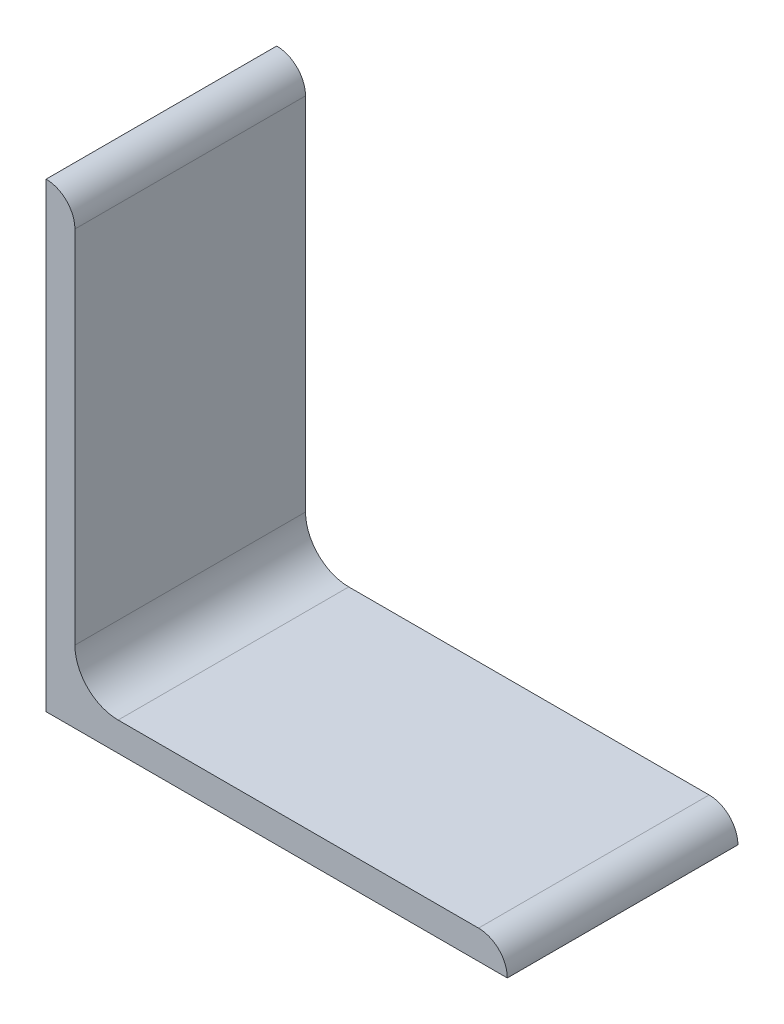
ISO-10303-21;
HEADER;
FILE_DESCRIPTION(('STEP AP214'),'2;1');
FILE_NAME('part.step','',(''),(''),'','','');
FILE_SCHEMA(('AUTOMOTIVE_DESIGN { 1 0 10303 214 1 1 1 1 }'));
ENDSEC;
DATA;
#1=APPLICATION_CONTEXT('core data for automotive mechanical design processes');
#2=APPLICATION_PROTOCOL_DEFINITION('international standard','automotive_design',2000,#1);
#3=PRODUCT_CONTEXT('',#1,'mechanical');
#4=PRODUCT('Part','Part','',(#3));
#5=PRODUCT_RELATED_PRODUCT_CATEGORY('part','',(#4));
#6=PRODUCT_DEFINITION_FORMATION('','',#4);
#7=PRODUCT_DEFINITION_CONTEXT('part definition',#1,'design');
#8=PRODUCT_DEFINITION('design','',#6,#7);
#9=PRODUCT_DEFINITION_SHAPE('','',#8);
#10=(LENGTH_UNIT() NAMED_UNIT(*) SI_UNIT(.MILLI.,.METRE.));
#11=(NAMED_UNIT(*) PLANE_ANGLE_UNIT() SI_UNIT($,.RADIAN.));
#12=(NAMED_UNIT(*) SI_UNIT($,.STERADIAN.) SOLID_ANGLE_UNIT());
#13=UNCERTAINTY_MEASURE_WITH_UNIT(LENGTH_MEASURE(1.E-05),#10,'distance_accuracy_value','');
#14=(GEOMETRIC_REPRESENTATION_CONTEXT(3) GLOBAL_UNCERTAINTY_ASSIGNED_CONTEXT((#13)) GLOBAL_UNIT_ASSIGNED_CONTEXT((#10,
#11,#12)) REPRESENTATION_CONTEXT('',''));
#15=CARTESIAN_POINT('',(0.,0.,0.));
#16=DIRECTION('',(0.,0.,1.));
#17=DIRECTION('',(1.,0.,0.));
#18=AXIS2_PLACEMENT_3D('',#15,#16,#17);
#19=CARTESIAN_POINT('',(-2.84113318571218,-8.5391888301944,46.8070937624464));
#20=DIRECTION('',(0.,1.,0.));
#21=DIRECTION('',(0.,0.,1.));
#22=AXIS2_PLACEMENT_3D('',#19,#20,#21);
#23=PLANE('',#22);
#24=DIRECTION('',(1.,0.,0.));
#25=VECTOR('',#24,1.);
#26=CARTESIAN_POINT('',(-2.84113318571218,-8.5391888301944,21.4070937624464));
#27=LINE('',#26,#25);
#28=CARTESIAN_POINT('',(-53.6411331857121,-8.5391888301944,21.4070937624464));
#29=VERTEX_POINT('',#28);
#30=CARTESIAN_POINT('',(-2.84113318571218,-8.5391888301944,21.4070937624464));
#31=VERTEX_POINT('',#30);
#32=EDGE_CURVE('E136',#29,#31,#27,.T.);
#33=ORIENTED_EDGE('',*,*,#32,.T.);
#34=DIRECTION('',(0.,0.,-1.));
#35=VECTOR('',#34,1.);
#36=CARTESIAN_POINT('',(-2.84113318571218,-8.5391888301944,46.8070937624464));
#37=LINE('',#36,#35);
#38=CARTESIAN_POINT('',(-2.84113318571218,-8.5391888301944,46.8070937624464));
#39=VERTEX_POINT('',#38);
#40=EDGE_CURVE('E11',#39,#31,#37,.T.);
#41=ORIENTED_EDGE('',*,*,#40,.F.);
#42=DIRECTION('',(1.,0.,0.));
#43=VECTOR('',#42,1.);
#44=CARTESIAN_POINT('',(-2.84113318571218,-8.5391888301944,46.8070937624464));
#45=LINE('',#44,#43);
#46=CARTESIAN_POINT('',(-53.6411331857121,-8.5391888301944,46.8070937624464));
#47=VERTEX_POINT('',#46);
#48=EDGE_CURVE('E152',#47,#39,#45,.T.);
#49=ORIENTED_EDGE('',*,*,#48,.F.);
#50=DIRECTION('',(0.,0.,-1.));
#51=VECTOR('',#50,1.);
#52=CARTESIAN_POINT('',(-53.6411331857121,-8.5391888301944,46.8070937624464));
#53=LINE('',#52,#51);
#54=EDGE_CURVE('E132',#47,#29,#53,.T.);
#55=ORIENTED_EDGE('',*,*,#54,.T.);
#56=EDGE_LOOP('',(#33,#41,#49,#55));
#57=FACE_BOUND('',#56,.T.);
#58=ADVANCED_FACE('F34',(#57),#23,.F.);
#59=CARTESIAN_POINT('',(-2.84113318571218,-8.5341088301944,46.8070937624464));
#60=DIRECTION('',(-1.,0.,0.));
#61=DIRECTION('',(0.,0.,1.));
#62=AXIS2_PLACEMENT_3D('',#59,#60,#61);
#63=PLANE('',#62);
#64=DIRECTION('',(0.,1.,0.));
#65=VECTOR('',#64,1.);
#66=CARTESIAN_POINT('',(-2.84113318571218,-8.5341088301944,21.4070937624464));
#67=LINE('',#66,#65);
#68=CARTESIAN_POINT('',(-2.84113318571218,-8.5341088301944,21.4070937624464));
#69=VERTEX_POINT('',#68);
#70=EDGE_CURVE('E139',#31,#69,#67,.T.);
#71=ORIENTED_EDGE('',*,*,#70,.T.);
#72=DIRECTION('',(0.,0.,-1.));
#73=VECTOR('',#72,1.);
#74=CARTESIAN_POINT('',(-2.84113318571218,-8.5341088301944,46.8070937624464));
#75=LINE('',#74,#73);
#76=CARTESIAN_POINT('',(-2.84113318571218,-8.5341088301944,46.8070937624464));
#77=VERTEX_POINT('',#76);
#78=EDGE_CURVE('E42',#77,#69,#75,.T.);
#79=ORIENTED_EDGE('',*,*,#78,.F.);
#80=DIRECTION('',(0.,1.,0.));
#81=VECTOR('',#80,1.);
#82=CARTESIAN_POINT('',(-2.84113318571218,-8.5341088301944,46.8070937624464));
#83=LINE('',#82,#81);
#84=EDGE_CURVE('E96',#39,#77,#83,.T.);
#85=ORIENTED_EDGE('',*,*,#84,.F.);
#86=ORIENTED_EDGE('',*,*,#40,.T.);
#87=EDGE_LOOP('',(#71,#79,#85,#86));
#88=FACE_BOUND('',#87,.T.);
#89=ADVANCED_FACE('F195',(#88),#63,.F.);
#90=CARTESIAN_POINT('',(-6.01105318571217,-8.5341088301944,46.8070937624464));
#91=DIRECTION('',(0.,0.,-1.));
#92=DIRECTION('',(-1.,0.,0.));
#93=AXIS2_PLACEMENT_3D('',#90,#91,#92);
#94=CYLINDRICAL_SURFACE('',#93,3.16991999999999);
#95=CARTESIAN_POINT('',(-6.01105318571217,-8.5341088301944,21.4070937624464));
#96=DIRECTION('',(0.,0.,1.));
#97=DIRECTION('',(1.,0.,0.));
#98=AXIS2_PLACEMENT_3D('',#95,#96,#97);
#99=CIRCLE('',#98,3.16991999999999);
#100=CARTESIAN_POINT('',(-6.01105318571217,-5.36418883019441,21.4070937624464));
#101=VERTEX_POINT('',#100);
#102=EDGE_CURVE('E141',#69,#101,#99,.T.);
#103=ORIENTED_EDGE('',*,*,#102,.T.);
#104=DIRECTION('',(0.,0.,-1.));
#105=VECTOR('',#104,1.);
#106=CARTESIAN_POINT('',(-6.01105318571217,-5.36418883019441,46.8070937624464));
#107=LINE('',#106,#105);
#108=CARTESIAN_POINT('',(-6.01105318571217,-5.36418883019441,46.8070937624464));
#109=VERTEX_POINT('',#108);
#110=EDGE_CURVE('E162',#109,#101,#107,.T.);
#111=ORIENTED_EDGE('',*,*,#110,.F.);
#112=CARTESIAN_POINT('',(-6.01105318571217,-8.5341088301944,46.8070937624464));
#113=DIRECTION('',(0.,0.,1.));
#114=DIRECTION('',(1.,0.,0.));
#115=AXIS2_PLACEMENT_3D('',#112,#113,#114);
#116=CIRCLE('',#115,3.16991999999999);
#117=EDGE_CURVE('E170',#77,#109,#116,.T.);
#118=ORIENTED_EDGE('',*,*,#117,.F.);
#119=ORIENTED_EDGE('',*,*,#78,.T.);
#120=EDGE_LOOP('',(#103,#111,#118,#119));
#121=FACE_BOUND('',#120,.T.);
#122=ADVANCED_FACE('F168',(#121),#94,.T.);
#123=CARTESIAN_POINT('',(-45.7036331857121,-5.36418883019441,46.8070937624464));
#124=DIRECTION('',(0.,-1.,0.));
#125=DIRECTION('',(1.,0.,0.));
#126=AXIS2_PLACEMENT_3D('',#123,#124,#125);
#127=PLANE('',#126);
#128=DIRECTION('',(-1.,0.,0.));
#129=VECTOR('',#128,1.);
#130=CARTESIAN_POINT('',(-45.7036331857121,-5.36418883019441,21.4070937624464));
#131=LINE('',#130,#129);
#132=CARTESIAN_POINT('',(-45.7036331857121,-5.36418883019441,21.4070937624464));
#133=VERTEX_POINT('',#132);
#134=EDGE_CURVE('E143',#101,#133,#131,.T.);
#135=ORIENTED_EDGE('',*,*,#134,.T.);
#136=DIRECTION('',(0.,0.,-1.));
#137=VECTOR('',#136,1.);
#138=CARTESIAN_POINT('',(-45.7036331857121,-5.36418883019441,46.8070937624464));
#139=LINE('',#138,#137);
#140=CARTESIAN_POINT('',(-45.7036331857121,-5.36418883019441,46.8070937624464));
#141=VERTEX_POINT('',#140);
#142=EDGE_CURVE('E159',#141,#133,#139,.T.);
#143=ORIENTED_EDGE('',*,*,#142,.F.);
#144=DIRECTION('',(-1.,0.,0.));
#145=VECTOR('',#144,1.);
#146=CARTESIAN_POINT('',(-45.7036331857121,-5.36418883019441,46.8070937624464));
#147=LINE('',#146,#145);
#148=EDGE_CURVE('E186',#109,#141,#147,.T.);
#149=ORIENTED_EDGE('',*,*,#148,.F.);
#150=ORIENTED_EDGE('',*,*,#110,.T.);
#151=EDGE_LOOP('',(#135,#143,#149,#150));
#152=FACE_BOUND('',#151,.T.);
#153=ADVANCED_FACE('F179',(#152),#127,.F.);
#154=CARTESIAN_POINT('',(-45.7036331857121,-0.601688830194409,46.8070937624464));
#155=DIRECTION('',(0.,0.,-1.));
#156=DIRECTION('',(-1.,0.,0.));
#157=AXIS2_PLACEMENT_3D('',#154,#155,#156);
#158=CYLINDRICAL_SURFACE('',#157,4.7625);
#159=CARTESIAN_POINT('',(-45.7036331857121,-0.601688830194409,21.4070937624464));
#160=DIRECTION('',(0.,0.,-1.));
#161=DIRECTION('',(-1.,0.,0.));
#162=AXIS2_PLACEMENT_3D('',#159,#160,#161);
#163=CIRCLE('',#162,4.7625);
#164=CARTESIAN_POINT('',(-50.4661331857121,-0.601688830194409,21.4070937624464));
#165=VERTEX_POINT('',#164);
#166=EDGE_CURVE('E145',#133,#165,#163,.T.);
#167=ORIENTED_EDGE('',*,*,#166,.T.);
#168=DIRECTION('',(0.,0.,-1.));
#169=VECTOR('',#168,1.);
#170=CARTESIAN_POINT('',(-50.4661331857121,-0.601688830194409,46.8070937624464));
#171=LINE('',#170,#169);
#172=CARTESIAN_POINT('',(-50.4661331857121,-0.601688830194409,46.8070937624464));
#173=VERTEX_POINT('',#172);
#174=EDGE_CURVE('E156',#173,#165,#171,.T.);
#175=ORIENTED_EDGE('',*,*,#174,.F.);
#176=CARTESIAN_POINT('',(-45.7036331857121,-0.601688830194409,46.8070937624464));
#177=DIRECTION('',(0.,0.,-1.));
#178=DIRECTION('',(-1.,0.,0.));
#179=AXIS2_PLACEMENT_3D('',#176,#177,#178);
#180=CIRCLE('',#179,4.7625);
#181=EDGE_CURVE('E185',#141,#173,#180,.T.);
#182=ORIENTED_EDGE('',*,*,#181,.F.);
#183=ORIENTED_EDGE('',*,*,#142,.T.);
#184=EDGE_LOOP('',(#167,#175,#182,#183));
#185=FACE_BOUND('',#184,.T.);
#186=ADVANCED_FACE('F183',(#185),#158,.F.);
#187=CARTESIAN_POINT('',(-50.4661331857121,39.0908911698056,46.8070937624464));
#188=DIRECTION('',(-1.,0.,0.));
#189=DIRECTION('',(0.,-1.,0.));
#190=AXIS2_PLACEMENT_3D('',#187,#188,#189);
#191=PLANE('',#190);
#192=DIRECTION('',(0.,1.,0.));
#193=VECTOR('',#192,1.);
#194=CARTESIAN_POINT('',(-50.4661331857121,39.0908911698056,21.4070937624464));
#195=LINE('',#194,#193);
#196=CARTESIAN_POINT('',(-50.4661331857121,39.0908911698056,21.4070937624464));
#197=VERTEX_POINT('',#196);
#198=EDGE_CURVE('E147',#165,#197,#195,.T.);
#199=ORIENTED_EDGE('',*,*,#198,.T.);
#200=DIRECTION('',(0.,0.,-1.));
#201=VECTOR('',#200,1.);
#202=CARTESIAN_POINT('',(-50.4661331857121,39.0908911698056,46.8070937624464));
#203=LINE('',#202,#201);
#204=CARTESIAN_POINT('',(-50.4661331857121,39.0908911698056,46.8070937624464));
#205=VERTEX_POINT('',#204);
#206=EDGE_CURVE('E127',#205,#197,#203,.T.);
#207=ORIENTED_EDGE('',*,*,#206,.F.);
#208=DIRECTION('',(0.,1.,0.));
#209=VECTOR('',#208,1.);
#210=CARTESIAN_POINT('',(-50.4661331857121,39.0908911698056,46.8070937624464));
#211=LINE('',#210,#209);
#212=EDGE_CURVE('E118',#173,#205,#211,.T.);
#213=ORIENTED_EDGE('',*,*,#212,.F.);
#214=ORIENTED_EDGE('',*,*,#174,.T.);
#215=EDGE_LOOP('',(#199,#207,#213,#214));
#216=FACE_BOUND('',#215,.T.);
#217=ADVANCED_FACE('F207',(#216),#191,.F.);
#218=CARTESIAN_POINT('',(-53.6360531857121,39.0908911698056,46.8070937624464));
#219=DIRECTION('',(0.,0.,-1.));
#220=DIRECTION('',(-1.,0.,0.));
#221=AXIS2_PLACEMENT_3D('',#218,#219,#220);
#222=CYLINDRICAL_SURFACE('',#221,3.16992);
#223=CARTESIAN_POINT('',(-53.6360531857121,39.0908911698056,21.4070937624464));
#224=DIRECTION('',(0.,0.,1.));
#225=DIRECTION('',(-1.,0.,0.));
#226=AXIS2_PLACEMENT_3D('',#223,#224,#225);
#227=CIRCLE('',#226,3.16992);
#228=CARTESIAN_POINT('',(-53.6360531857121,42.2608111698056,21.4070937624464));
#229=VERTEX_POINT('',#228);
#230=EDGE_CURVE('E126',#197,#229,#227,.T.);
#231=ORIENTED_EDGE('',*,*,#230,.T.);
#232=DIRECTION('',(0.,0.,-1.));
#233=VECTOR('',#232,1.);
#234=CARTESIAN_POINT('',(-53.6360531857121,42.2608111698056,46.8070937624464));
#235=LINE('',#234,#233);
#236=CARTESIAN_POINT('',(-53.6360531857121,42.2608111698056,46.8070937624464));
#237=VERTEX_POINT('',#236);
#238=EDGE_CURVE('E123',#237,#229,#235,.T.);
#239=ORIENTED_EDGE('',*,*,#238,.F.);
#240=CARTESIAN_POINT('',(-53.6360531857121,39.0908911698056,46.8070937624464));
#241=DIRECTION('',(0.,0.,1.));
#242=DIRECTION('',(-1.,0.,0.));
#243=AXIS2_PLACEMENT_3D('',#240,#241,#242);
#244=CIRCLE('',#243,3.16992);
#245=EDGE_CURVE('E112',#205,#237,#244,.T.);
#246=ORIENTED_EDGE('',*,*,#245,.F.);
#247=ORIENTED_EDGE('',*,*,#206,.T.);
#248=EDGE_LOOP('',(#231,#239,#246,#247));
#249=FACE_BOUND('',#248,.T.);
#250=ADVANCED_FACE('F124',(#249),#222,.T.);
#251=CARTESIAN_POINT('',(-53.6411331857121,42.2608111698056,46.8070937624464));
#252=DIRECTION('',(0.,-1.,0.));
#253=DIRECTION('',(0.,0.,-1.));
#254=AXIS2_PLACEMENT_3D('',#251,#252,#253);
#255=PLANE('',#254);
#256=DIRECTION('',(-1.,0.,0.));
#257=VECTOR('',#256,1.);
#258=CARTESIAN_POINT('',(-53.6411331857121,42.2608111698056,21.4070937624464));
#259=LINE('',#258,#257);
#260=CARTESIAN_POINT('',(-53.6411331857121,42.2608111698056,21.4070937624464));
#261=VERTEX_POINT('',#260);
#262=EDGE_CURVE('E82',#229,#261,#259,.T.);
#263=ORIENTED_EDGE('',*,*,#262,.T.);
#264=DIRECTION('',(0.,0.,-1.));
#265=VECTOR('',#264,1.);
#266=CARTESIAN_POINT('',(-53.6411331857121,42.2608111698056,46.8070937624464));
#267=LINE('',#266,#265);
#268=CARTESIAN_POINT('',(-53.6411331857121,42.2608111698056,46.8070937624464));
#269=VERTEX_POINT('',#268);
#270=EDGE_CURVE('E128',#269,#261,#267,.T.);
#271=ORIENTED_EDGE('',*,*,#270,.F.);
#272=DIRECTION('',(-1.,0.,0.));
#273=VECTOR('',#272,1.);
#274=CARTESIAN_POINT('',(-53.6411331857121,42.2608111698056,46.8070937624464));
#275=LINE('',#274,#273);
#276=EDGE_CURVE('E116',#237,#269,#275,.T.);
#277=ORIENTED_EDGE('',*,*,#276,.F.);
#278=ORIENTED_EDGE('',*,*,#238,.T.);
#279=EDGE_LOOP('',(#263,#271,#277,#278));
#280=FACE_BOUND('',#279,.T.);
#281=ADVANCED_FACE('F130',(#280),#255,.F.);
#282=CARTESIAN_POINT('',(-53.6411331857121,-8.5391888301944,46.8070937624464));
#283=DIRECTION('',(1.,0.,0.));
#284=DIRECTION('',(0.,1.,0.));
#285=AXIS2_PLACEMENT_3D('',#282,#283,#284);
#286=PLANE('',#285);
#287=DIRECTION('',(0.,-1.,0.));
#288=VECTOR('',#287,1.);
#289=CARTESIAN_POINT('',(-53.6411331857121,-8.5391888301944,21.4070937624464));
#290=LINE('',#289,#288);
#291=EDGE_CURVE('E88',#261,#29,#290,.T.);
#292=ORIENTED_EDGE('',*,*,#291,.T.);
#293=ORIENTED_EDGE('',*,*,#54,.F.);
#294=DIRECTION('',(0.,-1.,0.));
#295=VECTOR('',#294,1.);
#296=CARTESIAN_POINT('',(-53.6411331857121,-8.5391888301944,46.8070937624464));
#297=LINE('',#296,#295);
#298=EDGE_CURVE('E50',#269,#47,#297,.T.);
#299=ORIENTED_EDGE('',*,*,#298,.F.);
#300=ORIENTED_EDGE('',*,*,#270,.T.);
#301=EDGE_LOOP('',(#292,#293,#299,#300));
#302=FACE_BOUND('',#301,.T.);
#303=ADVANCED_FACE('F215',(#302),#286,.F.);
#304=CARTESIAN_POINT('',(-53.6360531857121,39.0908911698056,46.8070937624464));
#305=DIRECTION('',(0.,0.,-1.));
#306=DIRECTION('',(-1.,0.,0.));
#307=AXIS2_PLACEMENT_3D('',#304,#305,#306);
#308=PLANE('',#307);
#309=ORIENTED_EDGE('',*,*,#48,.T.);
#310=ORIENTED_EDGE('',*,*,#84,.T.);
#311=ORIENTED_EDGE('',*,*,#117,.T.);
#312=ORIENTED_EDGE('',*,*,#148,.T.);
#313=ORIENTED_EDGE('',*,*,#181,.T.);
#314=ORIENTED_EDGE('',*,*,#212,.T.);
#315=ORIENTED_EDGE('',*,*,#245,.T.);
#316=ORIENTED_EDGE('',*,*,#276,.T.);
#317=ORIENTED_EDGE('',*,*,#298,.T.);
#318=EDGE_LOOP('',(#309,#310,#311,#312,#313,#314,#315,#316,#317));
#319=FACE_BOUND('',#318,.T.);
#320=ADVANCED_FACE('F114',(#319),#308,.F.);
#321=CARTESIAN_POINT('',(-53.6360531857121,39.0908911698056,21.4070937624464));
#322=DIRECTION('',(0.,0.,-1.));
#323=DIRECTION('',(-1.,0.,0.));
#324=AXIS2_PLACEMENT_3D('',#321,#322,#323);
#325=PLANE('',#324);
#326=ORIENTED_EDGE('',*,*,#32,.F.);
#327=ORIENTED_EDGE('',*,*,#291,.F.);
#328=ORIENTED_EDGE('',*,*,#262,.F.);
#329=ORIENTED_EDGE('',*,*,#230,.F.);
#330=ORIENTED_EDGE('',*,*,#198,.F.);
#331=ORIENTED_EDGE('',*,*,#166,.F.);
#332=ORIENTED_EDGE('',*,*,#134,.F.);
#333=ORIENTED_EDGE('',*,*,#102,.F.);
#334=ORIENTED_EDGE('',*,*,#70,.F.);
#335=EDGE_LOOP('',(#326,#327,#328,#329,#330,#331,#332,#333,#334));
#336=FACE_BOUND('',#335,.T.);
#337=ADVANCED_FACE('F174',(#336),#325,.T.);
#338=CLOSED_SHELL('',(#58,#89,#122,#153,#186,#217,#250,#281,#303,#320,#337));
#339=MANIFOLD_SOLID_BREP('B2',#338);
#340=ADVANCED_BREP_SHAPE_REPRESENTATION('',(#18,#339),#14);
#341=SHAPE_DEFINITION_REPRESENTATION(#9,#340);
ENDSEC;
END-ISO-10303-21;
